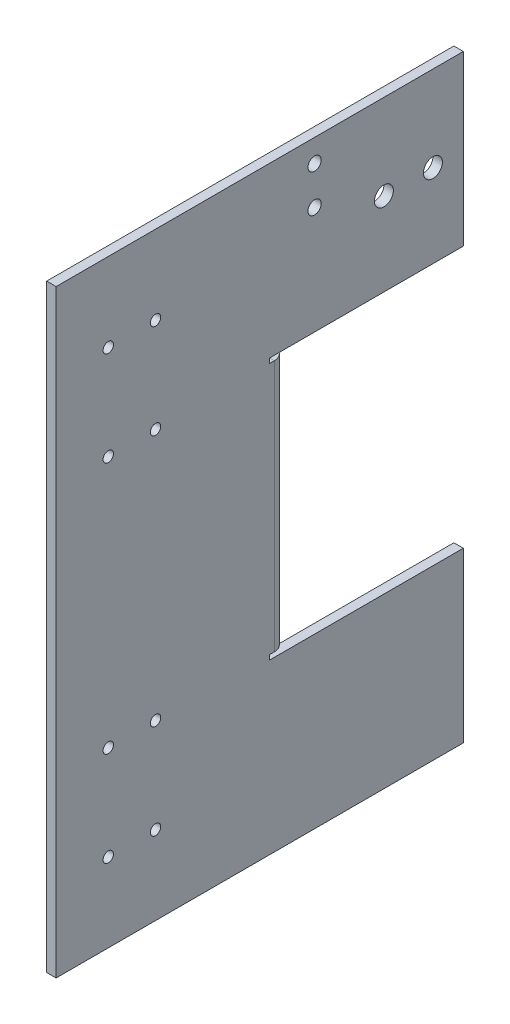
ISO-10303-21;
HEADER;
FILE_DESCRIPTION(('STEP AP214'),'2;1');
FILE_NAME('part.step','',(''),(''),'','','');
FILE_SCHEMA(('AUTOMOTIVE_DESIGN { 1 0 10303 214 1 1 1 1 }'));
ENDSEC;
DATA;
#1=APPLICATION_CONTEXT('core data for automotive mechanical design processes');
#2=APPLICATION_PROTOCOL_DEFINITION('international standard','automotive_design',2000,#1);
#3=PRODUCT_CONTEXT('',#1,'mechanical');
#4=PRODUCT('Part','Part','',(#3));
#5=PRODUCT_RELATED_PRODUCT_CATEGORY('part','',(#4));
#6=PRODUCT_DEFINITION_FORMATION('','',#4);
#7=PRODUCT_DEFINITION_CONTEXT('part definition',#1,'design');
#8=PRODUCT_DEFINITION('design','',#6,#7);
#9=PRODUCT_DEFINITION_SHAPE('','',#8);
#10=(LENGTH_UNIT() NAMED_UNIT(*) SI_UNIT(.MILLI.,.METRE.));
#11=(NAMED_UNIT(*) PLANE_ANGLE_UNIT() SI_UNIT($,.RADIAN.));
#12=(NAMED_UNIT(*) SI_UNIT($,.STERADIAN.) SOLID_ANGLE_UNIT());
#13=UNCERTAINTY_MEASURE_WITH_UNIT(LENGTH_MEASURE(1.E-05),#10,'distance_accuracy_value','');
#14=(GEOMETRIC_REPRESENTATION_CONTEXT(3) GLOBAL_UNCERTAINTY_ASSIGNED_CONTEXT((#13)) GLOBAL_UNIT_ASSIGNED_CONTEXT((#10,
#11,#12)) REPRESENTATION_CONTEXT('',''));
#15=CARTESIAN_POINT('',(0.,0.,0.));
#16=DIRECTION('',(0.,0.,1.));
#17=DIRECTION('',(1.,0.,0.));
#18=AXIS2_PLACEMENT_3D('',#15,#16,#17);
#19=CARTESIAN_POINT('',(3.,0.,-89.2));
#20=DIRECTION('',(-1.,0.,0.));
#21=DIRECTION('',(0.,0.,-1.));
#22=AXIS2_PLACEMENT_3D('',#19,#20,#21);
#23=PLANE('',#22);
#24=CARTESIAN_POINT('',(3.,162.91,-104.));
#25=DIRECTION('',(-1.,0.,0.));
#26=DIRECTION('',(0.,0.,1.));
#27=AXIS2_PLACEMENT_3D('',#24,#25,#26);
#28=CIRCLE('',#27,3.00000000000001);
#29=CARTESIAN_POINT('',(3.,162.91,-101.));
#30=VERTEX_POINT('',#29);
#31=EDGE_CURVE('E482',#30,#30,#28,.T.);
#32=ORIENTED_EDGE('',*,*,#31,.T.);
#33=EDGE_LOOP('',(#32));
#34=FACE_BOUND('',#33,.T.);
#35=CARTESIAN_POINT('',(3.,162.91,-119.55));
#36=DIRECTION('',(-1.,0.,0.));
#37=DIRECTION('',(0.,0.,1.));
#38=AXIS2_PLACEMENT_3D('',#35,#36,#37);
#39=CIRCLE('',#38,3.00000000000001);
#40=CARTESIAN_POINT('',(3.,162.91,-116.55));
#41=VERTEX_POINT('',#40);
#42=EDGE_CURVE('E486',#41,#41,#39,.T.);
#43=ORIENTED_EDGE('',*,*,#42,.T.);
#44=EDGE_LOOP('',(#43));
#45=FACE_BOUND('',#44,.T.);
#46=CARTESIAN_POINT('',(3.,170.770000000001,-82.0000000000004));
#47=DIRECTION('',(-1.,0.,0.));
#48=DIRECTION('',(0.,0.,1.));
#49=AXIS2_PLACEMENT_3D('',#46,#47,#48);
#50=CIRCLE('',#49,2.09999999999999);
#51=CARTESIAN_POINT('',(3.,170.770000000001,-79.9000000000004));
#52=VERTEX_POINT('',#51);
#53=EDGE_CURVE('E434',#52,#52,#50,.T.);
#54=ORIENTED_EDGE('',*,*,#53,.T.);
#55=EDGE_LOOP('',(#54));
#56=FACE_BOUND('',#55,.T.);
#57=CARTESIAN_POINT('',(3.,182.770000000001,-82.0000000000004));
#58=DIRECTION('',(-1.,0.,0.));
#59=DIRECTION('',(0.,0.,1.));
#60=AXIS2_PLACEMENT_3D('',#57,#58,#59);
#61=CIRCLE('',#60,2.09999999999999);
#62=CARTESIAN_POINT('',(3.,182.770000000001,-79.9000000000004));
#63=VERTEX_POINT('',#62);
#64=EDGE_CURVE('E444',#63,#63,#61,.T.);
#65=ORIENTED_EDGE('',*,*,#64,.T.);
#66=EDGE_LOOP('',(#65));
#67=FACE_BOUND('',#66,.T.);
#68=CARTESIAN_POINT('',(3.,25.0000000000001,-31.5440191940723));
#69=DIRECTION('',(-1.,0.,0.));
#70=DIRECTION('',(0.,0.,1.));
#71=AXIS2_PLACEMENT_3D('',#68,#69,#70);
#72=CIRCLE('',#71,1.64999999999999);
#73=CARTESIAN_POINT('',(3.,25.0000000000001,-29.8940191940724));
#74=VERTEX_POINT('',#73);
#75=EDGE_CURVE('E269',#74,#74,#72,.T.);
#76=ORIENTED_EDGE('',*,*,#75,.T.);
#77=EDGE_LOOP('',(#76));
#78=FACE_BOUND('',#77,.T.);
#79=CARTESIAN_POINT('',(3.,25.0000000000001,-16.5440191940723));
#80=DIRECTION('',(-1.,0.,0.));
#81=DIRECTION('',(0.,0.,1.));
#82=AXIS2_PLACEMENT_3D('',#79,#80,#81);
#83=CIRCLE('',#82,1.64999999999999);
#84=CARTESIAN_POINT('',(3.,25.0000000000001,-14.8940191940724));
#85=VERTEX_POINT('',#84);
#86=EDGE_CURVE('E259',#85,#85,#83,.T.);
#87=ORIENTED_EDGE('',*,*,#86,.T.);
#88=EDGE_LOOP('',(#87));
#89=FACE_BOUND('',#88,.T.);
#90=CARTESIAN_POINT('',(3.,55.0000000000001,-31.5440191940723));
#91=DIRECTION('',(-1.,0.,0.));
#92=DIRECTION('',(0.,0.,1.));
#93=AXIS2_PLACEMENT_3D('',#90,#91,#92);
#94=CIRCLE('',#93,1.64999999999999);
#95=CARTESIAN_POINT('',(3.,55.0000000000001,-29.8940191940724));
#96=VERTEX_POINT('',#95);
#97=EDGE_CURVE('E256',#96,#96,#94,.T.);
#98=ORIENTED_EDGE('',*,*,#97,.T.);
#99=EDGE_LOOP('',(#98));
#100=FACE_BOUND('',#99,.T.);
#101=CARTESIAN_POINT('',(3.,55.0000000000001,-16.5440191940723));
#102=DIRECTION('',(-1.,0.,0.));
#103=DIRECTION('',(0.,0.,1.));
#104=AXIS2_PLACEMENT_3D('',#101,#102,#103);
#105=CIRCLE('',#104,1.64999999999999);
#106=CARTESIAN_POINT('',(3.,55.0000000000001,-14.8940191940724));
#107=VERTEX_POINT('',#106);
#108=EDGE_CURVE('E253',#107,#107,#105,.T.);
#109=ORIENTED_EDGE('',*,*,#108,.T.);
#110=EDGE_LOOP('',(#109));
#111=FACE_BOUND('',#110,.T.);
#112=CARTESIAN_POINT('',(3.,135.,-16.5440191940723));
#113=DIRECTION('',(-1.,0.,0.));
#114=DIRECTION('',(0.,0.,1.));
#115=AXIS2_PLACEMENT_3D('',#112,#113,#114);
#116=CIRCLE('',#115,1.64999999999998);
#117=CARTESIAN_POINT('',(3.,135.,-14.8940191940724));
#118=VERTEX_POINT('',#117);
#119=EDGE_CURVE('E252',#118,#118,#116,.T.);
#120=ORIENTED_EDGE('',*,*,#119,.T.);
#121=EDGE_LOOP('',(#120));
#122=FACE_BOUND('',#121,.T.);
#123=CARTESIAN_POINT('',(3.,135.,-31.5440191940723));
#124=DIRECTION('',(-1.,0.,0.));
#125=DIRECTION('',(0.,0.,1.));
#126=AXIS2_PLACEMENT_3D('',#123,#124,#125);
#127=CIRCLE('',#126,1.64999999999998);
#128=CARTESIAN_POINT('',(3.,135.,-29.8940191940724));
#129=VERTEX_POINT('',#128);
#130=EDGE_CURVE('E280',#129,#129,#127,.T.);
#131=ORIENTED_EDGE('',*,*,#130,.T.);
#132=EDGE_LOOP('',(#131));
#133=FACE_BOUND('',#132,.T.);
#134=CARTESIAN_POINT('',(3.,165.,-16.5440191940723));
#135=DIRECTION('',(-1.,0.,0.));
#136=DIRECTION('',(0.,0.,1.));
#137=AXIS2_PLACEMENT_3D('',#134,#135,#136);
#138=CIRCLE('',#137,1.64999999999998);
#139=CARTESIAN_POINT('',(3.,165.,-14.8940191940724));
#140=VERTEX_POINT('',#139);
#141=EDGE_CURVE('E286',#140,#140,#138,.T.);
#142=ORIENTED_EDGE('',*,*,#141,.T.);
#143=EDGE_LOOP('',(#142));
#144=FACE_BOUND('',#143,.T.);
#145=CARTESIAN_POINT('',(3.,165.,-31.5440191940723));
#146=DIRECTION('',(-1.,0.,0.));
#147=DIRECTION('',(0.,0.,1.));
#148=AXIS2_PLACEMENT_3D('',#145,#146,#147);
#149=CIRCLE('',#148,1.64999999999998);
#150=CARTESIAN_POINT('',(3.,165.,-29.8940191940724));
#151=VERTEX_POINT('',#150);
#152=EDGE_CURVE('E248',#151,#151,#149,.T.);
#153=ORIENTED_EDGE('',*,*,#152,.T.);
#154=EDGE_LOOP('',(#153));
#155=FACE_BOUND('',#154,.T.);
#156=DIRECTION('',(0.,0.,1.));
#157=VECTOR('',#156,1.);
#158=CARTESIAN_POINT('',(3.,53.5,-89.2));
#159=LINE('',#158,#157);
#160=CARTESIAN_POINT('',(3.,53.5,-129.2));
#161=VERTEX_POINT('',#160);
#162=CARTESIAN_POINT('',(3.,53.5,-67.7634));
#163=VERTEX_POINT('',#162);
#164=EDGE_CURVE('E196',#161,#163,#159,.T.);
#165=ORIENTED_EDGE('',*,*,#164,.T.);
#166=DIRECTION('',(0.,1.,0.));
#167=VECTOR('',#166,1.);
#168=CARTESIAN_POINT('',(3.,0.,-67.7634));
#169=LINE('',#168,#167);
#170=CARTESIAN_POINT('',(3.,55.,-67.7634));
#171=VERTEX_POINT('',#170);
#172=EDGE_CURVE('E205',#163,#171,#169,.T.);
#173=ORIENTED_EDGE('',*,*,#172,.T.);
#174=DIRECTION('',(0.,0.,-1.));
#175=VECTOR('',#174,1.);
#176=CARTESIAN_POINT('',(3.,55.,-89.2));
#177=LINE('',#176,#175);
#178=CARTESIAN_POINT('',(3.,55.,-69.2634));
#179=VERTEX_POINT('',#178);
#180=EDGE_CURVE('E208',#171,#179,#177,.T.);
#181=ORIENTED_EDGE('',*,*,#180,.T.);
#182=DIRECTION('',(0.,1.,0.));
#183=VECTOR('',#182,1.);
#184=CARTESIAN_POINT('',(3.,135.,-69.2634));
#185=LINE('',#184,#183);
#186=CARTESIAN_POINT('',(3.,135.,-69.2634));
#187=VERTEX_POINT('',#186);
#188=EDGE_CURVE('E355',#187,#179,#185,.F.);
#189=ORIENTED_EDGE('',*,*,#188,.F.);
#190=DIRECTION('',(0.,0.,1.));
#191=VECTOR('',#190,1.);
#192=CARTESIAN_POINT('',(3.,135.,-89.2));
#193=LINE('',#192,#191);
#194=CARTESIAN_POINT('',(3.,135.,-67.7634));
#195=VERTEX_POINT('',#194);
#196=EDGE_CURVE('E219',#187,#195,#193,.T.);
#197=ORIENTED_EDGE('',*,*,#196,.T.);
#198=DIRECTION('',(0.,1.,0.));
#199=VECTOR('',#198,1.);
#200=CARTESIAN_POINT('',(3.,0.,-67.7634));
#201=LINE('',#200,#199);
#202=CARTESIAN_POINT('',(3.,136.5,-67.7634));
#203=VERTEX_POINT('',#202);
#204=EDGE_CURVE('E222',#195,#203,#201,.T.);
#205=ORIENTED_EDGE('',*,*,#204,.T.);
#206=DIRECTION('',(0.,0.,-1.));
#207=VECTOR('',#206,1.);
#208=CARTESIAN_POINT('',(3.,136.5,-89.2));
#209=LINE('',#208,#207);
#210=CARTESIAN_POINT('',(3.,136.5,-129.2));
#211=VERTEX_POINT('',#210);
#212=EDGE_CURVE('E225',#203,#211,#209,.T.);
#213=ORIENTED_EDGE('',*,*,#212,.T.);
#214=DIRECTION('',(0.,1.,0.));
#215=VECTOR('',#214,1.);
#216=CARTESIAN_POINT('',(3.,190.,-129.2));
#217=LINE('',#216,#215);
#218=CARTESIAN_POINT('',(3.,190.,-129.2));
#219=VERTEX_POINT('',#218);
#220=EDGE_CURVE('E429',#211,#219,#217,.T.);
#221=ORIENTED_EDGE('',*,*,#220,.T.);
#222=DIRECTION('',(0.,0.,1.));
#223=VECTOR('',#222,1.);
#224=CARTESIAN_POINT('',(3.,190.,-89.2));
#225=LINE('',#224,#223);
#226=CARTESIAN_POINT('',(3.,190.,0.));
#227=VERTEX_POINT('',#226);
#228=EDGE_CURVE('E11',#219,#227,#225,.T.);
#229=ORIENTED_EDGE('',*,*,#228,.T.);
#230=DIRECTION('',(0.,1.,0.));
#231=VECTOR('',#230,1.);
#232=CARTESIAN_POINT('',(3.,0.,0.));
#233=LINE('',#232,#231);
#234=CARTESIAN_POINT('',(3.,0.,0.));
#235=VERTEX_POINT('',#234);
#236=EDGE_CURVE('E228',#235,#227,#233,.T.);
#237=ORIENTED_EDGE('',*,*,#236,.F.);
#238=DIRECTION('',(0.,0.,1.));
#239=VECTOR('',#238,1.);
#240=CARTESIAN_POINT('',(3.,0.,-89.2));
#241=LINE('',#240,#239);
#242=CARTESIAN_POINT('',(3.,0.,-129.2));
#243=VERTEX_POINT('',#242);
#244=EDGE_CURVE('E199',#243,#235,#241,.T.);
#245=ORIENTED_EDGE('',*,*,#244,.F.);
#246=DIRECTION('',(0.,1.,0.));
#247=VECTOR('',#246,1.);
#248=CARTESIAN_POINT('',(3.,53.5,-129.2));
#249=LINE('',#248,#247);
#250=EDGE_CURVE('E184',#243,#161,#249,.T.);
#251=ORIENTED_EDGE('',*,*,#250,.T.);
#252=EDGE_LOOP('',(#165,#173,#181,#189,#197,#205,#213,#221,#229,#237,#245,#251));
#253=FACE_BOUND('',#252,.T.);
#254=ADVANCED_FACE('F41',(#34,#45,#56,#67,#78,#89,#100,#111,#122,#133,#144,#155,#253),#23,.F.);
#255=CARTESIAN_POINT('',(0.,0.,-89.2));
#256=DIRECTION('',(-1.,0.,0.));
#257=DIRECTION('',(0.,0.,-1.));
#258=AXIS2_PLACEMENT_3D('',#255,#256,#257);
#259=PLANE('',#258);
#260=CARTESIAN_POINT('',(0.,162.91,-104.));
#261=DIRECTION('',(-1.,0.,0.));
#262=DIRECTION('',(0.,0.,1.));
#263=AXIS2_PLACEMENT_3D('',#260,#261,#262);
#264=CIRCLE('',#263,3.00000000000001);
#265=CARTESIAN_POINT('',(0.,162.91,-101.));
#266=VERTEX_POINT('',#265);
#267=EDGE_CURVE('E516',#266,#266,#264,.T.);
#268=ORIENTED_EDGE('',*,*,#267,.F.);
#269=EDGE_LOOP('',(#268));
#270=FACE_BOUND('',#269,.T.);
#271=CARTESIAN_POINT('',(0.,162.91,-119.55));
#272=DIRECTION('',(-1.,0.,0.));
#273=DIRECTION('',(0.,0.,1.));
#274=AXIS2_PLACEMENT_3D('',#271,#272,#273);
#275=CIRCLE('',#274,3.00000000000001);
#276=CARTESIAN_POINT('',(0.,162.91,-116.55));
#277=VERTEX_POINT('',#276);
#278=EDGE_CURVE('E200',#277,#277,#275,.T.);
#279=ORIENTED_EDGE('',*,*,#278,.F.);
#280=EDGE_LOOP('',(#279));
#281=FACE_BOUND('',#280,.T.);
#282=CARTESIAN_POINT('',(0.,170.770000000001,-82.0000000000004));
#283=DIRECTION('',(1.,0.,0.));
#284=DIRECTION('',(0.,0.,-1.));
#285=AXIS2_PLACEMENT_3D('',#282,#283,#284);
#286=CIRCLE('',#285,2.09999999999999);
#287=CARTESIAN_POINT('',(0.,170.770000000001,-84.1000000000004));
#288=VERTEX_POINT('',#287);
#289=EDGE_CURVE('E441',#288,#288,#286,.T.);
#290=ORIENTED_EDGE('',*,*,#289,.T.);
#291=EDGE_LOOP('',(#290));
#292=FACE_BOUND('',#291,.T.);
#293=CARTESIAN_POINT('',(0.,182.770000000001,-82.0000000000004));
#294=DIRECTION('',(1.,0.,0.));
#295=DIRECTION('',(0.,0.,-1.));
#296=AXIS2_PLACEMENT_3D('',#293,#294,#295);
#297=CIRCLE('',#296,2.09999999999999);
#298=CARTESIAN_POINT('',(0.,182.770000000001,-84.1000000000004));
#299=VERTEX_POINT('',#298);
#300=EDGE_CURVE('E446',#299,#299,#297,.T.);
#301=ORIENTED_EDGE('',*,*,#300,.T.);
#302=EDGE_LOOP('',(#301));
#303=FACE_BOUND('',#302,.T.);
#304=CARTESIAN_POINT('',(0.,25.0000000000001,-31.5440191940723));
#305=DIRECTION('',(1.,0.,0.));
#306=DIRECTION('',(0.,0.,-1.));
#307=AXIS2_PLACEMENT_3D('',#304,#305,#306);
#308=CIRCLE('',#307,1.64999999999999);
#309=CARTESIAN_POINT('',(0.,25.0000000000001,-33.1940191940723));
#310=VERTEX_POINT('',#309);
#311=EDGE_CURVE('E44',#310,#310,#308,.T.);
#312=ORIENTED_EDGE('',*,*,#311,.T.);
#313=EDGE_LOOP('',(#312));
#314=FACE_BOUND('',#313,.T.);
#315=CARTESIAN_POINT('',(0.,25.0000000000001,-16.5440191940723));
#316=DIRECTION('',(1.,0.,0.));
#317=DIRECTION('',(0.,0.,-1.));
#318=AXIS2_PLACEMENT_3D('',#315,#316,#317);
#319=CIRCLE('',#318,1.64999999999999);
#320=CARTESIAN_POINT('',(0.,25.0000000000001,-18.1940191940723));
#321=VERTEX_POINT('',#320);
#322=EDGE_CURVE('E257',#321,#321,#319,.T.);
#323=ORIENTED_EDGE('',*,*,#322,.T.);
#324=EDGE_LOOP('',(#323));
#325=FACE_BOUND('',#324,.T.);
#326=CARTESIAN_POINT('',(0.,55.0000000000001,-31.5440191940723));
#327=DIRECTION('',(1.,0.,0.));
#328=DIRECTION('',(0.,0.,-1.));
#329=AXIS2_PLACEMENT_3D('',#326,#327,#328);
#330=CIRCLE('',#329,1.64999999999999);
#331=CARTESIAN_POINT('',(0.,55.0000000000001,-33.1940191940723));
#332=VERTEX_POINT('',#331);
#333=EDGE_CURVE('E254',#332,#332,#330,.T.);
#334=ORIENTED_EDGE('',*,*,#333,.T.);
#335=EDGE_LOOP('',(#334));
#336=FACE_BOUND('',#335,.T.);
#337=CARTESIAN_POINT('',(0.,55.0000000000001,-16.5440191940723));
#338=DIRECTION('',(1.,0.,0.));
#339=DIRECTION('',(0.,0.,-1.));
#340=AXIS2_PLACEMENT_3D('',#337,#338,#339);
#341=CIRCLE('',#340,1.64999999999999);
#342=CARTESIAN_POINT('',(0.,55.0000000000001,-18.1940191940723));
#343=VERTEX_POINT('',#342);
#344=EDGE_CURVE('E249',#343,#343,#341,.T.);
#345=ORIENTED_EDGE('',*,*,#344,.T.);
#346=EDGE_LOOP('',(#345));
#347=FACE_BOUND('',#346,.T.);
#348=CARTESIAN_POINT('',(0.,135.,-16.5440191940723));
#349=DIRECTION('',(1.,0.,0.));
#350=DIRECTION('',(0.,0.,-1.));
#351=AXIS2_PLACEMENT_3D('',#348,#349,#350);
#352=CIRCLE('',#351,1.64999999999998);
#353=CARTESIAN_POINT('',(0.,135.,-18.1940191940723));
#354=VERTEX_POINT('',#353);
#355=EDGE_CURVE('E277',#354,#354,#352,.T.);
#356=ORIENTED_EDGE('',*,*,#355,.T.);
#357=EDGE_LOOP('',(#356));
#358=FACE_BOUND('',#357,.T.);
#359=CARTESIAN_POINT('',(0.,135.,-31.5440191940723));
#360=DIRECTION('',(1.,0.,0.));
#361=DIRECTION('',(0.,0.,-1.));
#362=AXIS2_PLACEMENT_3D('',#359,#360,#361);
#363=CIRCLE('',#362,1.64999999999998);
#364=CARTESIAN_POINT('',(0.,135.,-33.1940191940723));
#365=VERTEX_POINT('',#364);
#366=EDGE_CURVE('E283',#365,#365,#363,.T.);
#367=ORIENTED_EDGE('',*,*,#366,.T.);
#368=EDGE_LOOP('',(#367));
#369=FACE_BOUND('',#368,.T.);
#370=CARTESIAN_POINT('',(0.,165.,-16.5440191940723));
#371=DIRECTION('',(1.,0.,0.));
#372=DIRECTION('',(0.,0.,-1.));
#373=AXIS2_PLACEMENT_3D('',#370,#371,#372);
#374=CIRCLE('',#373,1.64999999999998);
#375=CARTESIAN_POINT('',(0.,165.,-18.1940191940723));
#376=VERTEX_POINT('',#375);
#377=EDGE_CURVE('E289',#376,#376,#374,.T.);
#378=ORIENTED_EDGE('',*,*,#377,.T.);
#379=EDGE_LOOP('',(#378));
#380=FACE_BOUND('',#379,.T.);
#381=CARTESIAN_POINT('',(0.,165.,-31.5440191940723));
#382=DIRECTION('',(1.,0.,0.));
#383=DIRECTION('',(0.,0.,-1.));
#384=AXIS2_PLACEMENT_3D('',#381,#382,#383);
#385=CIRCLE('',#384,1.64999999999998);
#386=CARTESIAN_POINT('',(0.,165.,-33.1940191940723));
#387=VERTEX_POINT('',#386);
#388=EDGE_CURVE('E244',#387,#387,#385,.T.);
#389=ORIENTED_EDGE('',*,*,#388,.T.);
#390=EDGE_LOOP('',(#389));
#391=FACE_BOUND('',#390,.T.);
#392=DIRECTION('',(0.,0.,1.));
#393=VECTOR('',#392,1.);
#394=CARTESIAN_POINT('',(0.,0.,-89.2));
#395=LINE('',#394,#393);
#396=CARTESIAN_POINT('',(0.,0.,-129.2));
#397=VERTEX_POINT('',#396);
#398=CARTESIAN_POINT('',(0.,0.,0.));
#399=VERTEX_POINT('',#398);
#400=EDGE_CURVE('E239',#397,#399,#395,.T.);
#401=ORIENTED_EDGE('',*,*,#400,.T.);
#402=DIRECTION('',(0.,1.,0.));
#403=VECTOR('',#402,1.);
#404=CARTESIAN_POINT('',(0.,0.,0.));
#405=LINE('',#404,#403);
#406=CARTESIAN_POINT('',(0.,190.,0.));
#407=VERTEX_POINT('',#406);
#408=EDGE_CURVE('E233',#399,#407,#405,.T.);
#409=ORIENTED_EDGE('',*,*,#408,.T.);
#410=DIRECTION('',(0.,0.,1.));
#411=VECTOR('',#410,1.);
#412=CARTESIAN_POINT('',(0.,190.,-89.2));
#413=LINE('',#412,#411);
#414=CARTESIAN_POINT('',(0.,190.,-129.2));
#415=VERTEX_POINT('',#414);
#416=EDGE_CURVE('E49',#415,#407,#413,.T.);
#417=ORIENTED_EDGE('',*,*,#416,.F.);
#418=DIRECTION('',(0.,-1.,0.));
#419=VECTOR('',#418,1.);
#420=CARTESIAN_POINT('',(0.,190.,-129.2));
#421=LINE('',#420,#419);
#422=CARTESIAN_POINT('',(0.,136.5,-129.2));
#423=VERTEX_POINT('',#422);
#424=EDGE_CURVE('E423',#415,#423,#421,.T.);
#425=ORIENTED_EDGE('',*,*,#424,.T.);
#426=DIRECTION('',(0.,0.,1.));
#427=VECTOR('',#426,1.);
#428=CARTESIAN_POINT('',(0.,136.5,-73.));
#429=LINE('',#428,#427);
#430=CARTESIAN_POINT('',(0.,136.5,-67.7634));
#431=VERTEX_POINT('',#430);
#432=EDGE_CURVE('E206',#423,#431,#429,.T.);
#433=ORIENTED_EDGE('',*,*,#432,.T.);
#434=DIRECTION('',(0.,-1.,0.));
#435=VECTOR('',#434,1.);
#436=CARTESIAN_POINT('',(0.,136.5,-67.7634));
#437=LINE('',#436,#435);
#438=CARTESIAN_POINT('',(0.,135.,-67.7634));
#439=VERTEX_POINT('',#438);
#440=EDGE_CURVE('E211',#431,#439,#437,.T.);
#441=ORIENTED_EDGE('',*,*,#440,.T.);
#442=DIRECTION('',(0.,0.,-1.));
#443=VECTOR('',#442,1.);
#444=CARTESIAN_POINT('',(0.,135.,-67.7634));
#445=LINE('',#444,#443);
#446=CARTESIAN_POINT('',(0.,135.,-69.2634));
#447=VERTEX_POINT('',#446);
#448=EDGE_CURVE('E378',#439,#447,#445,.T.);
#449=ORIENTED_EDGE('',*,*,#448,.T.);
#450=DIRECTION('',(0.,1.,0.));
#451=VECTOR('',#450,1.);
#452=CARTESIAN_POINT('',(0.,135.,-69.2634));
#453=LINE('',#452,#451);
#454=CARTESIAN_POINT('',(0.,55.,-69.2634));
#455=VERTEX_POINT('',#454);
#456=EDGE_CURVE('E367',#447,#455,#453,.F.);
#457=ORIENTED_EDGE('',*,*,#456,.T.);
#458=DIRECTION('',(0.,0.,1.));
#459=VECTOR('',#458,1.);
#460=CARTESIAN_POINT('',(0.,55.,-69.2634));
#461=LINE('',#460,#459);
#462=CARTESIAN_POINT('',(0.,55.,-67.7634));
#463=VERTEX_POINT('',#462);
#464=EDGE_CURVE('E382',#455,#463,#461,.T.);
#465=ORIENTED_EDGE('',*,*,#464,.T.);
#466=DIRECTION('',(0.,-1.,0.));
#467=VECTOR('',#466,1.);
#468=CARTESIAN_POINT('',(0.,55.,-67.7634));
#469=LINE('',#468,#467);
#470=CARTESIAN_POINT('',(0.,53.5,-67.7634));
#471=VERTEX_POINT('',#470);
#472=EDGE_CURVE('E385',#463,#471,#469,.T.);
#473=ORIENTED_EDGE('',*,*,#472,.T.);
#474=DIRECTION('',(0.,0.,-1.));
#475=VECTOR('',#474,1.);
#476=CARTESIAN_POINT('',(0.,53.5,-67.7634));
#477=LINE('',#476,#475);
#478=CARTESIAN_POINT('',(0.,53.5,-129.2));
#479=VERTEX_POINT('',#478);
#480=EDGE_CURVE('E389',#471,#479,#477,.T.);
#481=ORIENTED_EDGE('',*,*,#480,.T.);
#482=DIRECTION('',(0.,-1.,0.));
#483=VECTOR('',#482,1.);
#484=CARTESIAN_POINT('',(0.,53.5,-129.2));
#485=LINE('',#484,#483);
#486=EDGE_CURVE('E187',#479,#397,#485,.T.);
#487=ORIENTED_EDGE('',*,*,#486,.T.);
#488=EDGE_LOOP('',(#401,#409,#417,#425,#433,#441,#449,#457,#465,#473,#481,#487));
#489=FACE_BOUND('',#488,.T.);
#490=ADVANCED_FACE('F418',(#270,#281,#292,#303,#314,#325,#336,#347,#358,#369,#380,#391,#489),
#259,.T.);
#491=CARTESIAN_POINT('',(0.,190.,-89.2));
#492=DIRECTION('',(0.,1.,0.));
#493=DIRECTION('',(0.,0.,-1.));
#494=AXIS2_PLACEMENT_3D('',#491,#492,#493);
#495=PLANE('',#494);
#496=DIRECTION('',(1.,0.,0.));
#497=VECTOR('',#496,1.);
#498=CARTESIAN_POINT('',(0.,190.,0.));
#499=LINE('',#498,#497);
#500=EDGE_CURVE('E231',#407,#227,#499,.T.);
#501=ORIENTED_EDGE('',*,*,#500,.T.);
#502=ORIENTED_EDGE('',*,*,#228,.F.);
#503=DIRECTION('',(-1.,0.,0.));
#504=VECTOR('',#503,1.);
#505=CARTESIAN_POINT('',(0.,190.,-129.2));
#506=LINE('',#505,#504);
#507=EDGE_CURVE('E432',#219,#415,#506,.T.);
#508=ORIENTED_EDGE('',*,*,#507,.T.);
#509=ORIENTED_EDGE('',*,*,#416,.T.);
#510=EDGE_LOOP('',(#501,#502,#508,#509));
#511=FACE_BOUND('',#510,.T.);
#512=ADVANCED_FACE('F476',(#511),#495,.T.);
#513=CARTESIAN_POINT('',(3.,0.,-89.2));
#514=DIRECTION('',(0.,-1.,0.));
#515=DIRECTION('',(0.,0.,1.));
#516=AXIS2_PLACEMENT_3D('',#513,#514,#515);
#517=PLANE('',#516);
#518=DIRECTION('',(-1.,0.,0.));
#519=VECTOR('',#518,1.);
#520=CARTESIAN_POINT('',(3.,0.,0.));
#521=LINE('',#520,#519);
#522=EDGE_CURVE('E236',#235,#399,#521,.T.);
#523=ORIENTED_EDGE('',*,*,#522,.T.);
#524=ORIENTED_EDGE('',*,*,#400,.F.);
#525=DIRECTION('',(1.,0.,0.));
#526=VECTOR('',#525,1.);
#527=CARTESIAN_POINT('',(3.,0.,-129.2));
#528=LINE('',#527,#526);
#529=EDGE_CURVE('E524',#397,#243,#528,.T.);
#530=ORIENTED_EDGE('',*,*,#529,.T.);
#531=ORIENTED_EDGE('',*,*,#244,.T.);
#532=EDGE_LOOP('',(#523,#524,#530,#531));
#533=FACE_BOUND('',#532,.T.);
#534=ADVANCED_FACE('F527',(#533),#517,.T.);
#535=CARTESIAN_POINT('',(0.,0.,0.));
#536=DIRECTION('',(0.,0.,1.));
#537=DIRECTION('',(-1.,0.,0.));
#538=AXIS2_PLACEMENT_3D('',#535,#536,#537);
#539=PLANE('',#538);
#540=ORIENTED_EDGE('',*,*,#236,.T.);
#541=ORIENTED_EDGE('',*,*,#500,.F.);
#542=ORIENTED_EDGE('',*,*,#408,.F.);
#543=ORIENTED_EDGE('',*,*,#522,.F.);
#544=EDGE_LOOP('',(#540,#541,#542,#543));
#545=FACE_BOUND('',#544,.T.);
#546=ADVANCED_FACE('F586',(#545),#539,.T.);
#547=CARTESIAN_POINT('',(0.,136.5,-73.));
#548=DIRECTION('',(0.,-1.,0.));
#549=DIRECTION('',(0.,0.,1.));
#550=AXIS2_PLACEMENT_3D('',#547,#548,#549);
#551=PLANE('',#550);
#552=DIRECTION('',(1.,0.,0.));
#553=VECTOR('',#552,1.);
#554=CARTESIAN_POINT('',(0.,136.5,-67.7634));
#555=LINE('',#554,#553);
#556=EDGE_CURVE('E214',#431,#203,#555,.T.);
#557=ORIENTED_EDGE('',*,*,#556,.F.);
#558=ORIENTED_EDGE('',*,*,#432,.F.);
#559=DIRECTION('',(1.,0.,0.));
#560=VECTOR('',#559,1.);
#561=CARTESIAN_POINT('',(0.,136.5,-129.2));
#562=LINE('',#561,#560);
#563=EDGE_CURVE('E426',#423,#211,#562,.T.);
#564=ORIENTED_EDGE('',*,*,#563,.T.);
#565=ORIENTED_EDGE('',*,*,#212,.F.);
#566=EDGE_LOOP('',(#557,#558,#564,#565));
#567=FACE_BOUND('',#566,.T.);
#568=ADVANCED_FACE('F425',(#567),#551,.T.);
#569=CARTESIAN_POINT('',(0.,136.5,-67.7634));
#570=DIRECTION('',(0.,0.,-1.));
#571=DIRECTION('',(1.,0.,0.));
#572=AXIS2_PLACEMENT_3D('',#569,#570,#571);
#573=PLANE('',#572);
#574=DIRECTION('',(1.,0.,0.));
#575=VECTOR('',#574,1.);
#576=CARTESIAN_POINT('',(0.,135.,-67.7634));
#577=LINE('',#576,#575);
#578=EDGE_CURVE('E381',#439,#195,#577,.T.);
#579=ORIENTED_EDGE('',*,*,#578,.F.);
#580=ORIENTED_EDGE('',*,*,#440,.F.);
#581=ORIENTED_EDGE('',*,*,#556,.T.);
#582=ORIENTED_EDGE('',*,*,#204,.F.);
#583=EDGE_LOOP('',(#579,#580,#581,#582));
#584=FACE_BOUND('',#583,.T.);
#585=ADVANCED_FACE('F401',(#584),#573,.T.);
#586=CARTESIAN_POINT('',(0.,135.,-67.7634));
#587=DIRECTION('',(0.,1.,0.));
#588=DIRECTION('',(0.,0.,-1.));
#589=AXIS2_PLACEMENT_3D('',#586,#587,#588);
#590=PLANE('',#589);
#591=DIRECTION('',(1.,0.,0.));
#592=VECTOR('',#591,1.);
#593=CARTESIAN_POINT('',(0.,135.,-69.2634));
#594=LINE('',#593,#592);
#595=EDGE_CURVE('E362',#447,#187,#594,.T.);
#596=ORIENTED_EDGE('',*,*,#595,.F.);
#597=ORIENTED_EDGE('',*,*,#448,.F.);
#598=ORIENTED_EDGE('',*,*,#578,.T.);
#599=ORIENTED_EDGE('',*,*,#196,.F.);
#600=EDGE_LOOP('',(#596,#597,#598,#599));
#601=FACE_BOUND('',#600,.T.);
#602=ADVANCED_FACE('F397',(#601),#590,.T.);
#603=CARTESIAN_POINT('',(0.,55.,-69.2634));
#604=DIRECTION('',(0.,-1.,0.));
#605=DIRECTION('',(0.,0.,1.));
#606=AXIS2_PLACEMENT_3D('',#603,#604,#605);
#607=PLANE('',#606);
#608=DIRECTION('',(1.,0.,0.));
#609=VECTOR('',#608,1.);
#610=CARTESIAN_POINT('',(0.,55.,-67.7634));
#611=LINE('',#610,#609);
#612=EDGE_CURVE('E388',#463,#171,#611,.T.);
#613=ORIENTED_EDGE('',*,*,#612,.F.);
#614=ORIENTED_EDGE('',*,*,#464,.F.);
#615=DIRECTION('',(1.,0.,0.));
#616=VECTOR('',#615,1.);
#617=CARTESIAN_POINT('',(0.,55.,-69.2634));
#618=LINE('',#617,#616);
#619=EDGE_CURVE('E371',#455,#179,#618,.T.);
#620=ORIENTED_EDGE('',*,*,#619,.T.);
#621=ORIENTED_EDGE('',*,*,#180,.F.);
#622=EDGE_LOOP('',(#613,#614,#620,#621));
#623=FACE_BOUND('',#622,.T.);
#624=ADVANCED_FACE('F533',(#623),#607,.T.);
#625=CARTESIAN_POINT('',(0.,55.,-67.7634));
#626=DIRECTION('',(0.,0.,-1.));
#627=DIRECTION('',(1.,0.,0.));
#628=AXIS2_PLACEMENT_3D('',#625,#626,#627);
#629=PLANE('',#628);
#630=DIRECTION('',(1.,0.,0.));
#631=VECTOR('',#630,1.);
#632=CARTESIAN_POINT('',(0.,53.5,-67.7634));
#633=LINE('',#632,#631);
#634=EDGE_CURVE('E203',#471,#163,#633,.T.);
#635=ORIENTED_EDGE('',*,*,#634,.F.);
#636=ORIENTED_EDGE('',*,*,#472,.F.);
#637=ORIENTED_EDGE('',*,*,#612,.T.);
#638=ORIENTED_EDGE('',*,*,#172,.F.);
#639=EDGE_LOOP('',(#635,#636,#637,#638));
#640=FACE_BOUND('',#639,.T.);
#641=ADVANCED_FACE('F531',(#640),#629,.T.);
#642=CARTESIAN_POINT('',(0.,53.5,-67.7634));
#643=DIRECTION('',(0.,1.,0.));
#644=DIRECTION('',(0.,0.,-1.));
#645=AXIS2_PLACEMENT_3D('',#642,#643,#644);
#646=PLANE('',#645);
#647=ORIENTED_EDGE('',*,*,#480,.F.);
#648=ORIENTED_EDGE('',*,*,#634,.T.);
#649=ORIENTED_EDGE('',*,*,#164,.F.);
#650=DIRECTION('',(-1.,0.,0.));
#651=VECTOR('',#650,1.);
#652=CARTESIAN_POINT('',(3.,53.5,-129.2));
#653=LINE('',#652,#651);
#654=EDGE_CURVE('E181',#161,#479,#653,.T.);
#655=ORIENTED_EDGE('',*,*,#654,.T.);
#656=EDGE_LOOP('',(#647,#648,#649,#655));
#657=FACE_BOUND('',#656,.T.);
#658=ADVANCED_FACE('F202',(#657),#646,.T.);
#659=CARTESIAN_POINT('',(-0.736600000000004,55.,-69.2634));
#660=DIRECTION('',(0.,-1.,0.));
#661=DIRECTION('',(0.,0.,1.));
#662=AXIS2_PLACEMENT_3D('',#659,#660,#661);
#663=PLANE('',#662);
#664=DIRECTION('',(0.,0.,-1.));
#665=VECTOR('',#664,1.);
#666=CARTESIAN_POINT('',(-0.736600000000004,55.,-73.));
#667=LINE('',#666,#665);
#668=CARTESIAN_POINT('',(-0.736600000000002,55.,-70.));
#669=VERTEX_POINT('',#668);
#670=CARTESIAN_POINT('',(-0.736599999999992,55.,-73.));
#671=VERTEX_POINT('',#670);
#672=EDGE_CURVE('E322',#669,#671,#667,.T.);
#673=ORIENTED_EDGE('',*,*,#672,.T.);
#674=CARTESIAN_POINT('',(-0.736600000000004,55.,-69.2634));
#675=DIRECTION('',(0.,-1.,0.));
#676=DIRECTION('',(0.,0.,-1.));
#677=AXIS2_PLACEMENT_3D('',#674,#675,#676);
#678=CIRCLE('',#677,3.7366);
#679=EDGE_CURVE('E358',#179,#671,#678,.F.);
#680=ORIENTED_EDGE('',*,*,#679,.F.);
#681=ORIENTED_EDGE('',*,*,#619,.F.);
#682=CARTESIAN_POINT('',(-0.736600000000004,55.,-69.2634));
#683=DIRECTION('',(0.,-1.,0.));
#684=DIRECTION('',(0.,0.,-1.));
#685=AXIS2_PLACEMENT_3D('',#682,#683,#684);
#686=CIRCLE('',#685,0.736600000000004);
#687=EDGE_CURVE('E364',#455,#669,#686,.F.);
#688=ORIENTED_EDGE('',*,*,#687,.T.);
#689=EDGE_LOOP('',(#673,#680,#681,#688));
#690=FACE_BOUND('',#689,.T.);
#691=ADVANCED_FACE('F535',(#690),#663,.T.);
#692=CARTESIAN_POINT('',(-0.736600000000004,135.,-69.2634));
#693=DIRECTION('',(0.,-1.,0.));
#694=DIRECTION('',(0.,0.,1.));
#695=AXIS2_PLACEMENT_3D('',#692,#693,#694);
#696=PLANE('',#695);
#697=CARTESIAN_POINT('',(-0.736600000000004,135.,-69.2634));
#698=DIRECTION('',(0.,-1.,0.));
#699=DIRECTION('',(0.,0.,-1.));
#700=AXIS2_PLACEMENT_3D('',#697,#698,#699);
#701=CIRCLE('',#700,0.736600000000004);
#702=CARTESIAN_POINT('',(-0.736600000000002,135.,-70.));
#703=VERTEX_POINT('',#702);
#704=EDGE_CURVE('E326',#703,#447,#701,.T.);
#705=ORIENTED_EDGE('',*,*,#704,.T.);
#706=ORIENTED_EDGE('',*,*,#595,.T.);
#707=CARTESIAN_POINT('',(-0.736600000000004,135.,-69.2634));
#708=DIRECTION('',(0.,-1.,0.));
#709=DIRECTION('',(0.,0.,-1.));
#710=AXIS2_PLACEMENT_3D('',#707,#708,#709);
#711=CIRCLE('',#710,3.7366);
#712=CARTESIAN_POINT('',(-0.736600000000004,135.,-73.));
#713=VERTEX_POINT('',#712);
#714=EDGE_CURVE('E359',#713,#187,#711,.T.);
#715=ORIENTED_EDGE('',*,*,#714,.F.);
#716=DIRECTION('',(0.,0.,-1.));
#717=VECTOR('',#716,1.);
#718=CARTESIAN_POINT('',(-0.736600000000004,135.,-70.));
#719=LINE('',#718,#717);
#720=EDGE_CURVE('E347',#703,#713,#719,.T.);
#721=ORIENTED_EDGE('',*,*,#720,.F.);
#722=EDGE_LOOP('',(#705,#706,#715,#721));
#723=FACE_BOUND('',#722,.T.);
#724=ADVANCED_FACE('F410',(#723),#696,.F.);
#725=CARTESIAN_POINT('',(-0.736600000000004,135.,-69.2634));
#726=DIRECTION('',(0.,1.,0.));
#727=DIRECTION('',(0.,0.,-1.));
#728=AXIS2_PLACEMENT_3D('',#725,#726,#727);
#729=CYLINDRICAL_SURFACE('',#728,3.7366);
#730=ORIENTED_EDGE('',*,*,#188,.T.);
#731=ORIENTED_EDGE('',*,*,#679,.T.);
#732=DIRECTION('',(0.,1.,0.));
#733=VECTOR('',#732,1.);
#734=CARTESIAN_POINT('',(-0.736600000000004,0.,-73.));
#735=LINE('',#734,#733);
#736=EDGE_CURVE('E344',#671,#713,#735,.T.);
#737=ORIENTED_EDGE('',*,*,#736,.T.);
#738=ORIENTED_EDGE('',*,*,#714,.T.);
#739=EDGE_LOOP('',(#730,#731,#737,#738));
#740=FACE_BOUND('',#739,.T.);
#741=ADVANCED_FACE('F405',(#740),#729,.T.);
#742=CARTESIAN_POINT('',(-0.736600000000004,135.,-69.2634));
#743=DIRECTION('',(0.,1.,0.));
#744=DIRECTION('',(0.,0.,-1.));
#745=AXIS2_PLACEMENT_3D('',#742,#743,#744);
#746=CYLINDRICAL_SURFACE('',#745,0.736600000000004);
#747=ORIENTED_EDGE('',*,*,#456,.F.);
#748=ORIENTED_EDGE('',*,*,#704,.F.);
#749=DIRECTION('',(0.,-1.,0.));
#750=VECTOR('',#749,1.);
#751=CARTESIAN_POINT('',(-0.736600000000004,55.,-70.));
#752=LINE('',#751,#750);
#753=EDGE_CURVE('E350',#669,#703,#752,.F.);
#754=ORIENTED_EDGE('',*,*,#753,.F.);
#755=ORIENTED_EDGE('',*,*,#687,.F.);
#756=EDGE_LOOP('',(#747,#748,#754,#755));
#757=FACE_BOUND('',#756,.T.);
#758=ADVANCED_FACE('F414',(#757),#746,.F.);
#759=CARTESIAN_POINT('',(0.,135.,-73.));
#760=DIRECTION('',(0.,1.,0.));
#761=DIRECTION('',(0.,0.,-1.));
#762=AXIS2_PLACEMENT_3D('',#759,#760,#761);
#763=PLANE('',#762);
#764=DIRECTION('',(1.,0.,0.));
#765=VECTOR('',#764,1.);
#766=CARTESIAN_POINT('',(0.,135.,-73.));
#767=LINE('',#766,#765);
#768=CARTESIAN_POINT('',(-17.,135.,-73.));
#769=VERTEX_POINT('',#768);
#770=EDGE_CURVE('E330',#769,#713,#767,.T.);
#771=ORIENTED_EDGE('',*,*,#770,.F.);
#772=DIRECTION('',(0.,0.,1.));
#773=VECTOR('',#772,1.);
#774=CARTESIAN_POINT('',(-17.,135.,-73.));
#775=LINE('',#774,#773);
#776=CARTESIAN_POINT('',(-17.,135.,-70.));
#777=VERTEX_POINT('',#776);
#778=EDGE_CURVE('E323',#769,#777,#775,.T.);
#779=ORIENTED_EDGE('',*,*,#778,.T.);
#780=DIRECTION('',(-1.,0.,0.));
#781=VECTOR('',#780,1.);
#782=CARTESIAN_POINT('',(2.38371414110695E-13,135.,-70.));
#783=LINE('',#782,#781);
#784=EDGE_CURVE('E337',#777,#703,#783,.F.);
#785=ORIENTED_EDGE('',*,*,#784,.T.);
#786=ORIENTED_EDGE('',*,*,#720,.T.);
#787=EDGE_LOOP('',(#771,#779,#785,#786));
#788=FACE_BOUND('',#787,.T.);
#789=ADVANCED_FACE('F545',(#788),#763,.T.);
#790=CARTESIAN_POINT('',(-17.,55.,-73.));
#791=DIRECTION('',(0.,-1.,0.));
#792=DIRECTION('',(0.,0.,1.));
#793=AXIS2_PLACEMENT_3D('',#790,#791,#792);
#794=PLANE('',#793);
#795=DIRECTION('',(1.,0.,0.));
#796=VECTOR('',#795,1.);
#797=CARTESIAN_POINT('',(2.38371414110695E-13,55.,-70.));
#798=LINE('',#797,#796);
#799=CARTESIAN_POINT('',(-17.,55.,-70.));
#800=VERTEX_POINT('',#799);
#801=EDGE_CURVE('E341',#669,#800,#798,.F.);
#802=ORIENTED_EDGE('',*,*,#801,.T.);
#803=DIRECTION('',(0.,0.,1.));
#804=VECTOR('',#803,1.);
#805=CARTESIAN_POINT('',(-17.,55.,-73.));
#806=LINE('',#805,#804);
#807=CARTESIAN_POINT('',(-17.,55.,-73.));
#808=VERTEX_POINT('',#807);
#809=EDGE_CURVE('E327',#808,#800,#806,.T.);
#810=ORIENTED_EDGE('',*,*,#809,.F.);
#811=DIRECTION('',(-1.,0.,0.));
#812=VECTOR('',#811,1.);
#813=CARTESIAN_POINT('',(-17.,55.,-73.));
#814=LINE('',#813,#812);
#815=EDGE_CURVE('E334',#671,#808,#814,.T.);
#816=ORIENTED_EDGE('',*,*,#815,.F.);
#817=ORIENTED_EDGE('',*,*,#672,.F.);
#818=EDGE_LOOP('',(#802,#810,#816,#817));
#819=FACE_BOUND('',#818,.T.);
#820=ADVANCED_FACE('F538',(#819),#794,.T.);
#821=CARTESIAN_POINT('',(2.48845858127225E-13,0.,-73.));
#822=DIRECTION('',(0.,0.,-1.));
#823=DIRECTION('',(1.,0.,0.));
#824=AXIS2_PLACEMENT_3D('',#821,#822,#823);
#825=PLANE('',#824);
#826=CARTESIAN_POINT('',(-9.,80.,-73.));
#827=DIRECTION('',(0.,0.,1.));
#828=DIRECTION('',(1.,0.,0.));
#829=AXIS2_PLACEMENT_3D('',#826,#827,#828);
#830=CIRCLE('',#829,2.75);
#831=CARTESIAN_POINT('',(-11.75,80.,-73.));
#832=VERTEX_POINT('',#831);
#833=CARTESIAN_POINT('',(-6.25,80.,-73.));
#834=VERTEX_POINT('',#833);
#835=EDGE_CURVE('E319',#832,#834,#830,.T.);
#836=ORIENTED_EDGE('',*,*,#835,.T.);
#837=DIRECTION('',(0.,1.,0.));
#838=VECTOR('',#837,1.);
#839=CARTESIAN_POINT('',(-6.25000000000001,0.,-73.));
#840=LINE('',#839,#838);
#841=CARTESIAN_POINT('',(-6.25,110.,-73.));
#842=VERTEX_POINT('',#841);
#843=EDGE_CURVE('E316',#834,#842,#840,.T.);
#844=ORIENTED_EDGE('',*,*,#843,.T.);
#845=CARTESIAN_POINT('',(-9.,110.,-73.));
#846=DIRECTION('',(0.,0.,1.));
#847=DIRECTION('',(1.,0.,0.));
#848=AXIS2_PLACEMENT_3D('',#845,#846,#847);
#849=CIRCLE('',#848,2.75);
#850=CARTESIAN_POINT('',(-11.75,110.,-73.));
#851=VERTEX_POINT('',#850);
#852=EDGE_CURVE('E313',#842,#851,#849,.T.);
#853=ORIENTED_EDGE('',*,*,#852,.T.);
#854=DIRECTION('',(0.,-1.,0.));
#855=VECTOR('',#854,1.);
#856=CARTESIAN_POINT('',(-11.75,0.,-73.));
#857=LINE('',#856,#855);
#858=EDGE_CURVE('E306',#851,#832,#857,.T.);
#859=ORIENTED_EDGE('',*,*,#858,.T.);
#860=EDGE_LOOP('',(#836,#844,#853,#859));
#861=FACE_BOUND('',#860,.T.);
#862=ORIENTED_EDGE('',*,*,#815,.T.);
#863=DIRECTION('',(0.,1.,0.));
#864=VECTOR('',#863,1.);
#865=CARTESIAN_POINT('',(-17.,135.,-73.));
#866=LINE('',#865,#864);
#867=EDGE_CURVE('E332',#808,#769,#866,.T.);
#868=ORIENTED_EDGE('',*,*,#867,.T.);
#869=ORIENTED_EDGE('',*,*,#770,.T.);
#870=ORIENTED_EDGE('',*,*,#736,.F.);
#871=EDGE_LOOP('',(#862,#868,#869,#870));
#872=FACE_BOUND('',#871,.T.);
#873=ADVANCED_FACE('F541',(#861,#872),#825,.T.);
#874=CARTESIAN_POINT('',(2.38371414110695E-13,0.,-70.));
#875=DIRECTION('',(0.,0.,-1.));
#876=DIRECTION('',(1.,0.,0.));
#877=AXIS2_PLACEMENT_3D('',#874,#875,#876);
#878=PLANE('',#877);
#879=DIRECTION('',(0.,1.,0.));
#880=VECTOR('',#879,1.);
#881=CARTESIAN_POINT('',(-11.75,80.,-70.));
#882=LINE('',#881,#880);
#883=CARTESIAN_POINT('',(-11.75,80.,-70.));
#884=VERTEX_POINT('',#883);
#885=CARTESIAN_POINT('',(-11.75,110.,-70.));
#886=VERTEX_POINT('',#885);
#887=EDGE_CURVE('E295',#884,#886,#882,.T.);
#888=ORIENTED_EDGE('',*,*,#887,.T.);
#889=CARTESIAN_POINT('',(-9.00000000000001,110.,-70.));
#890=DIRECTION('',(0.,0.,-1.));
#891=DIRECTION('',(1.,0.,0.));
#892=AXIS2_PLACEMENT_3D('',#889,#890,#891);
#893=CIRCLE('',#892,2.75);
#894=CARTESIAN_POINT('',(-6.25000000000001,110.,-70.));
#895=VERTEX_POINT('',#894);
#896=EDGE_CURVE('E298',#886,#895,#893,.T.);
#897=ORIENTED_EDGE('',*,*,#896,.T.);
#898=DIRECTION('',(0.,-1.,0.));
#899=VECTOR('',#898,1.);
#900=CARTESIAN_POINT('',(-6.25000000000001,80.,-70.));
#901=LINE('',#900,#899);
#902=CARTESIAN_POINT('',(-6.25000000000001,80.,-70.));
#903=VERTEX_POINT('',#902);
#904=EDGE_CURVE('E301',#895,#903,#901,.T.);
#905=ORIENTED_EDGE('',*,*,#904,.T.);
#906=CARTESIAN_POINT('',(-9.00000000000001,80.,-70.));
#907=DIRECTION('',(0.,0.,-1.));
#908=DIRECTION('',(-1.,0.,0.));
#909=AXIS2_PLACEMENT_3D('',#906,#907,#908);
#910=CIRCLE('',#909,2.75);
#911=EDGE_CURVE('E247',#903,#884,#910,.T.);
#912=ORIENTED_EDGE('',*,*,#911,.T.);
#913=EDGE_LOOP('',(#888,#897,#905,#912));
#914=FACE_BOUND('',#913,.T.);
#915=ORIENTED_EDGE('',*,*,#753,.T.);
#916=ORIENTED_EDGE('',*,*,#784,.F.);
#917=DIRECTION('',(0.,-1.,0.));
#918=VECTOR('',#917,1.);
#919=CARTESIAN_POINT('',(-17.,0.,-70.));
#920=LINE('',#919,#918);
#921=EDGE_CURVE('E339',#800,#777,#920,.F.);
#922=ORIENTED_EDGE('',*,*,#921,.F.);
#923=ORIENTED_EDGE('',*,*,#801,.F.);
#924=EDGE_LOOP('',(#915,#916,#922,#923));
#925=FACE_BOUND('',#924,.T.);
#926=ADVANCED_FACE('F548',(#914,#925),#878,.F.);
#927=CARTESIAN_POINT('',(-17.,135.,-73.));
#928=DIRECTION('',(-1.,0.,0.));
#929=DIRECTION('',(0.,0.,-1.));
#930=AXIS2_PLACEMENT_3D('',#927,#928,#929);
#931=PLANE('',#930);
#932=ORIENTED_EDGE('',*,*,#921,.T.);
#933=ORIENTED_EDGE('',*,*,#778,.F.);
#934=ORIENTED_EDGE('',*,*,#867,.F.);
#935=ORIENTED_EDGE('',*,*,#809,.T.);
#936=EDGE_LOOP('',(#932,#933,#934,#935));
#937=FACE_BOUND('',#936,.T.);
#938=ADVANCED_FACE('F550',(#937),#931,.T.);
#939=CARTESIAN_POINT('',(-8.99999999999998,80.,-80.));
#940=DIRECTION('',(0.,0.,1.));
#941=DIRECTION('',(-1.,0.,0.));
#942=AXIS2_PLACEMENT_3D('',#939,#940,#941);
#943=CYLINDRICAL_SURFACE('',#942,2.75);
#944=ORIENTED_EDGE('',*,*,#835,.F.);
#945=DIRECTION('',(0.,0.,1.));
#946=VECTOR('',#945,1.);
#947=CARTESIAN_POINT('',(-11.75,80.,-80.));
#948=LINE('',#947,#946);
#949=EDGE_CURVE('E65',#832,#884,#948,.T.);
#950=ORIENTED_EDGE('',*,*,#949,.T.);
#951=ORIENTED_EDGE('',*,*,#911,.F.);
#952=DIRECTION('',(0.,0.,1.));
#953=VECTOR('',#952,1.);
#954=CARTESIAN_POINT('',(-6.24999999999998,80.,-80.));
#955=LINE('',#954,#953);
#956=EDGE_CURVE('E304',#834,#903,#955,.T.);
#957=ORIENTED_EDGE('',*,*,#956,.F.);
#958=EDGE_LOOP('',(#944,#950,#951,#957));
#959=FACE_BOUND('',#958,.T.);
#960=ADVANCED_FACE('F552',(#959),#943,.F.);
#961=CARTESIAN_POINT('',(-6.24999999999998,80.,-80.));
#962=DIRECTION('',(1.,0.,0.));
#963=DIRECTION('',(0.,0.,1.));
#964=AXIS2_PLACEMENT_3D('',#961,#962,#963);
#965=PLANE('',#964);
#966=ORIENTED_EDGE('',*,*,#843,.F.);
#967=ORIENTED_EDGE('',*,*,#956,.T.);
#968=ORIENTED_EDGE('',*,*,#904,.F.);
#969=DIRECTION('',(0.,0.,1.));
#970=VECTOR('',#969,1.);
#971=CARTESIAN_POINT('',(-6.24999999999998,110.,-80.));
#972=LINE('',#971,#970);
#973=EDGE_CURVE('E307',#842,#895,#972,.T.);
#974=ORIENTED_EDGE('',*,*,#973,.F.);
#975=EDGE_LOOP('',(#966,#967,#968,#974));
#976=FACE_BOUND('',#975,.T.);
#977=ADVANCED_FACE('F558',(#976),#965,.F.);
#978=CARTESIAN_POINT('',(-8.99999999999998,110.,-80.));
#979=DIRECTION('',(0.,0.,1.));
#980=DIRECTION('',(-1.,0.,0.));
#981=AXIS2_PLACEMENT_3D('',#978,#979,#980);
#982=CYLINDRICAL_SURFACE('',#981,2.75);
#983=ORIENTED_EDGE('',*,*,#852,.F.);
#984=ORIENTED_EDGE('',*,*,#973,.T.);
#985=ORIENTED_EDGE('',*,*,#896,.F.);
#986=DIRECTION('',(0.,0.,1.));
#987=VECTOR('',#986,1.);
#988=CARTESIAN_POINT('',(-11.75,110.,-80.));
#989=LINE('',#988,#987);
#990=EDGE_CURVE('E57',#851,#886,#989,.T.);
#991=ORIENTED_EDGE('',*,*,#990,.F.);
#992=EDGE_LOOP('',(#983,#984,#985,#991));
#993=FACE_BOUND('',#992,.T.);
#994=ADVANCED_FACE('F688',(#993),#982,.F.);
#995=CARTESIAN_POINT('',(-11.75,80.,-80.));
#996=DIRECTION('',(-1.,0.,0.));
#997=DIRECTION('',(0.,0.,-1.));
#998=AXIS2_PLACEMENT_3D('',#995,#996,#997);
#999=PLANE('',#998);
#1000=ORIENTED_EDGE('',*,*,#858,.F.);
#1001=ORIENTED_EDGE('',*,*,#990,.T.);
#1002=ORIENTED_EDGE('',*,*,#887,.F.);
#1003=ORIENTED_EDGE('',*,*,#949,.F.);
#1004=EDGE_LOOP('',(#1000,#1001,#1002,#1003));
#1005=FACE_BOUND('',#1004,.T.);
#1006=ADVANCED_FACE('F699',(#1005),#999,.F.);
#1007=CARTESIAN_POINT('',(3.,165.,-31.5440191940723));
#1008=DIRECTION('',(1.,0.,0.));
#1009=DIRECTION('',(0.,0.,1.));
#1010=AXIS2_PLACEMENT_3D('',#1007,#1008,#1009);
#1011=CYLINDRICAL_SURFACE('',#1010,1.64999999999998);
#1012=ORIENTED_EDGE('',*,*,#388,.F.);
#1013=EDGE_LOOP('',(#1012));
#1014=FACE_BOUND('',#1013,.T.);
#1015=ORIENTED_EDGE('',*,*,#152,.F.);
#1016=EDGE_LOOP('',(#1015));
#1017=FACE_BOUND('',#1016,.T.);
#1018=ADVANCED_FACE('F709',(#1014,#1017),#1011,.F.);
#1019=CARTESIAN_POINT('',(3.,165.,-16.5440191940723));
#1020=DIRECTION('',(1.,0.,0.));
#1021=DIRECTION('',(0.,0.,1.));
#1022=AXIS2_PLACEMENT_3D('',#1019,#1020,#1021);
#1023=CYLINDRICAL_SURFACE('',#1022,1.64999999999998);
#1024=ORIENTED_EDGE('',*,*,#377,.F.);
#1025=EDGE_LOOP('',(#1024));
#1026=FACE_BOUND('',#1025,.T.);
#1027=ORIENTED_EDGE('',*,*,#141,.F.);
#1028=EDGE_LOOP('',(#1027));
#1029=FACE_BOUND('',#1028,.T.);
#1030=ADVANCED_FACE('F721',(#1026,#1029),#1023,.F.);
#1031=CARTESIAN_POINT('',(3.,135.,-31.5440191940723));
#1032=DIRECTION('',(1.,0.,0.));
#1033=DIRECTION('',(0.,0.,1.));
#1034=AXIS2_PLACEMENT_3D('',#1031,#1032,#1033);
#1035=CYLINDRICAL_SURFACE('',#1034,1.64999999999998);
#1036=ORIENTED_EDGE('',*,*,#366,.F.);
#1037=EDGE_LOOP('',(#1036));
#1038=FACE_BOUND('',#1037,.T.);
#1039=ORIENTED_EDGE('',*,*,#130,.F.);
#1040=EDGE_LOOP('',(#1039));
#1041=FACE_BOUND('',#1040,.T.);
#1042=ADVANCED_FACE('F732',(#1038,#1041),#1035,.F.);
#1043=CARTESIAN_POINT('',(3.,135.,-16.5440191940723));
#1044=DIRECTION('',(1.,0.,0.));
#1045=DIRECTION('',(0.,0.,1.));
#1046=AXIS2_PLACEMENT_3D('',#1043,#1044,#1045);
#1047=CYLINDRICAL_SURFACE('',#1046,1.64999999999998);
#1048=ORIENTED_EDGE('',*,*,#355,.F.);
#1049=EDGE_LOOP('',(#1048));
#1050=FACE_BOUND('',#1049,.T.);
#1051=ORIENTED_EDGE('',*,*,#119,.F.);
#1052=EDGE_LOOP('',(#1051));
#1053=FACE_BOUND('',#1052,.T.);
#1054=ADVANCED_FACE('F743',(#1050,#1053),#1047,.F.);
#1055=CARTESIAN_POINT('',(3.,55.0000000000001,-16.5440191940723));
#1056=DIRECTION('',(1.,0.,0.));
#1057=DIRECTION('',(0.,0.,1.));
#1058=AXIS2_PLACEMENT_3D('',#1055,#1056,#1057);
#1059=CYLINDRICAL_SURFACE('',#1058,1.64999999999999);
#1060=ORIENTED_EDGE('',*,*,#344,.F.);
#1061=EDGE_LOOP('',(#1060));
#1062=FACE_BOUND('',#1061,.T.);
#1063=ORIENTED_EDGE('',*,*,#108,.F.);
#1064=EDGE_LOOP('',(#1063));
#1065=FACE_BOUND('',#1064,.T.);
#1066=ADVANCED_FACE('F754',(#1062,#1065),#1059,.F.);
#1067=CARTESIAN_POINT('',(3.,55.0000000000001,-31.5440191940723));
#1068=DIRECTION('',(1.,0.,0.));
#1069=DIRECTION('',(0.,0.,1.));
#1070=AXIS2_PLACEMENT_3D('',#1067,#1068,#1069);
#1071=CYLINDRICAL_SURFACE('',#1070,1.64999999999999);
#1072=ORIENTED_EDGE('',*,*,#333,.F.);
#1073=EDGE_LOOP('',(#1072));
#1074=FACE_BOUND('',#1073,.T.);
#1075=ORIENTED_EDGE('',*,*,#97,.F.);
#1076=EDGE_LOOP('',(#1075));
#1077=FACE_BOUND('',#1076,.T.);
#1078=ADVANCED_FACE('F467',(#1074,#1077),#1071,.F.);
#1079=CARTESIAN_POINT('',(3.,25.0000000000001,-16.5440191940723));
#1080=DIRECTION('',(1.,0.,0.));
#1081=DIRECTION('',(0.,0.,1.));
#1082=AXIS2_PLACEMENT_3D('',#1079,#1080,#1081);
#1083=CYLINDRICAL_SURFACE('',#1082,1.64999999999999);
#1084=ORIENTED_EDGE('',*,*,#322,.F.);
#1085=EDGE_LOOP('',(#1084));
#1086=FACE_BOUND('',#1085,.T.);
#1087=ORIENTED_EDGE('',*,*,#86,.F.);
#1088=EDGE_LOOP('',(#1087));
#1089=FACE_BOUND('',#1088,.T.);
#1090=ADVANCED_FACE('F457',(#1086,#1089),#1083,.F.);
#1091=CARTESIAN_POINT('',(3.,25.0000000000001,-31.5440191940723));
#1092=DIRECTION('',(1.,0.,0.));
#1093=DIRECTION('',(0.,0.,1.));
#1094=AXIS2_PLACEMENT_3D('',#1091,#1092,#1093);
#1095=CYLINDRICAL_SURFACE('',#1094,1.64999999999999);
#1096=ORIENTED_EDGE('',*,*,#311,.F.);
#1097=EDGE_LOOP('',(#1096));
#1098=FACE_BOUND('',#1097,.T.);
#1099=ORIENTED_EDGE('',*,*,#75,.F.);
#1100=EDGE_LOOP('',(#1099));
#1101=FACE_BOUND('',#1100,.T.);
#1102=ADVANCED_FACE('F454',(#1098,#1101),#1095,.F.);
#1103=CARTESIAN_POINT('',(3.,182.770000000001,-82.0000000000004));
#1104=DIRECTION('',(1.,0.,0.));
#1105=DIRECTION('',(0.,0.,1.));
#1106=AXIS2_PLACEMENT_3D('',#1103,#1104,#1105);
#1107=CYLINDRICAL_SURFACE('',#1106,2.09999999999999);
#1108=ORIENTED_EDGE('',*,*,#300,.F.);
#1109=EDGE_LOOP('',(#1108));
#1110=FACE_BOUND('',#1109,.T.);
#1111=ORIENTED_EDGE('',*,*,#64,.F.);
#1112=EDGE_LOOP('',(#1111));
#1113=FACE_BOUND('',#1112,.T.);
#1114=ADVANCED_FACE('F456',(#1110,#1113),#1107,.F.);
#1115=CARTESIAN_POINT('',(3.,170.770000000001,-82.0000000000004));
#1116=DIRECTION('',(1.,0.,0.));
#1117=DIRECTION('',(0.,0.,1.));
#1118=AXIS2_PLACEMENT_3D('',#1115,#1116,#1117);
#1119=CYLINDRICAL_SURFACE('',#1118,2.09999999999999);
#1120=ORIENTED_EDGE('',*,*,#289,.F.);
#1121=EDGE_LOOP('',(#1120));
#1122=FACE_BOUND('',#1121,.T.);
#1123=ORIENTED_EDGE('',*,*,#53,.F.);
#1124=EDGE_LOOP('',(#1123));
#1125=FACE_BOUND('',#1124,.T.);
#1126=ADVANCED_FACE('F464',(#1122,#1125),#1119,.F.);
#1127=CARTESIAN_POINT('',(0.,0.,-129.2));
#1128=DIRECTION('',(0.,0.,-1.));
#1129=DIRECTION('',(1.,0.,0.));
#1130=AXIS2_PLACEMENT_3D('',#1127,#1128,#1129);
#1131=PLANE('',#1130);
#1132=ORIENTED_EDGE('',*,*,#424,.F.);
#1133=ORIENTED_EDGE('',*,*,#507,.F.);
#1134=ORIENTED_EDGE('',*,*,#220,.F.);
#1135=ORIENTED_EDGE('',*,*,#563,.F.);
#1136=EDGE_LOOP('',(#1132,#1133,#1134,#1135));
#1137=FACE_BOUND('',#1136,.T.);
#1138=ADVANCED_FACE('F493',(#1137),#1131,.T.);
#1139=CARTESIAN_POINT('',(0.,0.,-129.2));
#1140=DIRECTION('',(0.,0.,1.));
#1141=DIRECTION('',(-1.,0.,0.));
#1142=AXIS2_PLACEMENT_3D('',#1139,#1140,#1141);
#1143=PLANE('',#1142);
#1144=ORIENTED_EDGE('',*,*,#250,.F.);
#1145=ORIENTED_EDGE('',*,*,#529,.F.);
#1146=ORIENTED_EDGE('',*,*,#486,.F.);
#1147=ORIENTED_EDGE('',*,*,#654,.F.);
#1148=EDGE_LOOP('',(#1144,#1145,#1146,#1147));
#1149=FACE_BOUND('',#1148,.T.);
#1150=ADVANCED_FACE('F183',(#1149),#1143,.F.);
#1151=CARTESIAN_POINT('',(0.,162.91,-119.55));
#1152=DIRECTION('',(1.,0.,0.));
#1153=DIRECTION('',(0.,0.,1.));
#1154=AXIS2_PLACEMENT_3D('',#1151,#1152,#1153);
#1155=CYLINDRICAL_SURFACE('',#1154,3.00000000000001);
#1156=ORIENTED_EDGE('',*,*,#278,.T.);
#1157=EDGE_LOOP('',(#1156));
#1158=FACE_BOUND('',#1157,.T.);
#1159=ORIENTED_EDGE('',*,*,#42,.F.);
#1160=EDGE_LOOP('',(#1159));
#1161=FACE_BOUND('',#1160,.T.);
#1162=ADVANCED_FACE('F504',(#1158,#1161),#1155,.F.);
#1163=CARTESIAN_POINT('',(0.,162.91,-104.));
#1164=DIRECTION('',(1.,0.,0.));
#1165=DIRECTION('',(0.,0.,1.));
#1166=AXIS2_PLACEMENT_3D('',#1163,#1164,#1165);
#1167=CYLINDRICAL_SURFACE('',#1166,3.00000000000001);
#1168=ORIENTED_EDGE('',*,*,#267,.T.);
#1169=EDGE_LOOP('',(#1168));
#1170=FACE_BOUND('',#1169,.T.);
#1171=ORIENTED_EDGE('',*,*,#31,.F.);
#1172=EDGE_LOOP('',(#1171));
#1173=FACE_BOUND('',#1172,.T.);
#1174=ADVANCED_FACE('F507',(#1170,#1173),#1167,.F.);
#1175=CLOSED_SHELL('',(#254,#490,#512,#534,#546,#568,#585,#602,#624,#641,#658,#691,#724,#741,
#758,#789,#820,#873,#926,#938,#960,#977,#994,#1006,#1018,#1030,#1042,#1054,#1066,#1078,#1090,
#1102,#1114,#1126,#1138,#1150,#1162,#1174));
#1176=MANIFOLD_SOLID_BREP('B2',#1175);
#1177=ADVANCED_BREP_SHAPE_REPRESENTATION('',(#18,#1176),#14);
#1178=SHAPE_DEFINITION_REPRESENTATION(#9,#1177);
ENDSEC;
END-ISO-10303-21;
